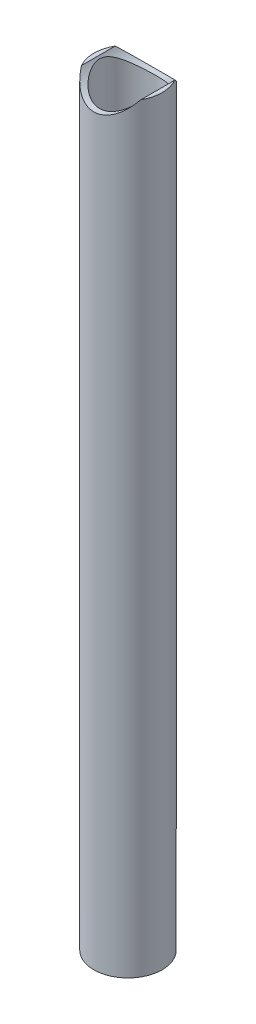
ISO-10303-21;
HEADER;
FILE_DESCRIPTION(('STEP AP214'),'2;1');
FILE_NAME('part.step','',(''),(''),'','','');
FILE_SCHEMA(('AUTOMOTIVE_DESIGN { 1 0 10303 214 1 1 1 1 }'));
ENDSEC;
DATA;
#1=APPLICATION_CONTEXT('core data for automotive mechanical design processes');
#2=APPLICATION_PROTOCOL_DEFINITION('international standard','automotive_design',2000,#1);
#3=PRODUCT_CONTEXT('',#1,'mechanical');
#4=PRODUCT('Part','Part','',(#3));
#5=PRODUCT_RELATED_PRODUCT_CATEGORY('part','',(#4));
#6=PRODUCT_DEFINITION_FORMATION('','',#4);
#7=PRODUCT_DEFINITION_CONTEXT('part definition',#1,'design');
#8=PRODUCT_DEFINITION('design','',#6,#7);
#9=PRODUCT_DEFINITION_SHAPE('','',#8);
#10=(LENGTH_UNIT() NAMED_UNIT(*) SI_UNIT(.MILLI.,.METRE.));
#11=(NAMED_UNIT(*) PLANE_ANGLE_UNIT() SI_UNIT($,.RADIAN.));
#12=(NAMED_UNIT(*) SI_UNIT($,.STERADIAN.) SOLID_ANGLE_UNIT());
#13=UNCERTAINTY_MEASURE_WITH_UNIT(LENGTH_MEASURE(1.E-05),#10,'distance_accuracy_value','');
#14=(GEOMETRIC_REPRESENTATION_CONTEXT(3) GLOBAL_UNCERTAINTY_ASSIGNED_CONTEXT((#13)) GLOBAL_UNIT_ASSIGNED_CONTEXT((#10,
#11,#12)) REPRESENTATION_CONTEXT('',''));
#15=CARTESIAN_POINT('',(0.,0.,0.));
#16=DIRECTION('',(0.,0.,1.));
#17=DIRECTION('',(1.,0.,0.));
#18=AXIS2_PLACEMENT_3D('',#15,#16,#17);
#19=CARTESIAN_POINT('',(0.,0.,0.));
#20=DIRECTION('',(0.,1.,0.));
#21=DIRECTION('',(0.,0.,1.));
#22=AXIS2_PLACEMENT_3D('',#19,#20,#21);
#23=CYLINDRICAL_SURFACE('',#22,17.526);
#24=CARTESIAN_POINT('',(17.5260000000057,467.884334709337,0.));
#25=CARTESIAN_POINT('',(17.5259966167378,467.88432617058,-0.319076188077624));
#26=CARTESIAN_POINT('',(17.51726257199,467.871890608762,-0.638240508763436));
#27=CARTESIAN_POINT('',(17.4825449115086,467.822784525985,-1.27387357273026));
#28=CARTESIAN_POINT('',(17.4565505154207,467.786098859123,-1.59034050610202));
#29=CARTESIAN_POINT('',(17.3878622453003,467.690215161303,-2.21880690947676));
#30=CARTESIAN_POINT('',(17.3451257780519,467.63095972172,-2.53079286403182));
#31=CARTESIAN_POINT('',(17.2438450795274,467.492571776205,-3.14774559895822));
#32=CARTESIAN_POINT('',(17.1852949843206,467.413431897585,-3.45270972991493));
#33=CARTESIAN_POINT('',(17.0290281907694,467.205942571117,-4.16540577796842));
#34=CARTESIAN_POINT('',(16.924830124194,467.070207980364,-4.56956911668166));
#35=CARTESIAN_POINT('',(16.6909426156402,466.774553737813,-5.36131842118699));
#36=CARTESIAN_POINT('',(16.5612408889475,466.614622439433,-5.7488962880344));
#37=CARTESIAN_POINT('',(16.2778377765882,466.27675589372,-6.50824927608016));
#38=CARTESIAN_POINT('',(16.1240772300419,466.098776656443,-6.8799824890451));
#39=CARTESIAN_POINT('',(15.7941184848056,465.730635525697,-7.60695943519018));
#40=CARTESIAN_POINT('',(15.6179210686258,465.540474057212,-7.96220374284949));
#41=CARTESIAN_POINT('',(15.1684387105771,465.074120916929,-8.79691850022176));
#42=CARTESIAN_POINT('',(14.8846663476882,464.794177119885,-9.26867500052876));
#43=CARTESIAN_POINT('',(14.2757977852007,464.228975234517,-10.1815187143384));
#44=CARTESIAN_POINT('',(13.9506852846529,463.943715087962,-10.6225937230168));
#45=CARTESIAN_POINT('',(13.2599882765244,463.376219321179,-11.4731513123116));
#46=CARTESIAN_POINT('',(12.8944394913868,463.093981269169,-11.8826612440536));
#47=CARTESIAN_POINT('',(12.1229083848525,462.539406738952,-12.6688154804112));
#48=CARTESIAN_POINT('',(11.7169405718745,462.267066755405,-13.0454714875213));
#49=CARTESIAN_POINT('',(10.9523102536056,461.793111751858,-13.6895404997737));
#50=CARTESIAN_POINT('',(10.6010399418016,461.588453168338,-13.9635083458199));
#51=CARTESIAN_POINT('',(9.87345155992662,461.19285074123,-14.4871138222371));
#52=CARTESIAN_POINT('',(9.49713454197172,461.001906322262,-14.7367524735));
#53=CARTESIAN_POINT('',(8.72070202883775,460.637341948865,-15.2090842162129));
#54=CARTESIAN_POINT('',(8.32061782316001,460.463699988611,-15.4318116129725));
#55=CARTESIAN_POINT('',(7.49751933777661,460.136876899184,-15.8480419800032));
#56=CARTESIAN_POINT('',(7.07450906657809,459.983692209281,-16.0415500368711));
#57=CARTESIAN_POINT('',(6.28025424486751,459.724825268381,-16.3667690599142));
#58=CARTESIAN_POINT('',(5.91221216564464,459.615484365574,-16.503401754469));
#59=CARTESIAN_POINT('',(5.16329368160522,459.415167450773,-16.7528138187347));
#60=CARTESIAN_POINT('',(4.7824196520745,459.324188061491,-16.8655975752347));
#61=CARTESIAN_POINT('',(4.00999437526974,459.162300485671,-17.0657472209478));
#62=CARTESIAN_POINT('',(3.61844688444468,459.091385335152,-17.1531219295349));
#63=CARTESIAN_POINT('',(2.82705689110886,458.971011274658,-17.3011693137797));
#64=CARTESIAN_POINT('',(2.42721429150704,458.921552615972,-17.3618416767118));
#65=CARTESIAN_POINT('',(1.62057958091167,458.845005592612,-17.4556549470083));
#66=CARTESIAN_POINT('',(1.2137664729376,458.818005078865,-17.4886877379134));
#67=CARTESIAN_POINT('',(0.397941374213328,458.787307210659,-17.5262391050122));
#68=CARTESIAN_POINT('',(-0.0110706209749511,458.783609903252,-17.530757623633));
#69=CARTESIAN_POINT('',(-0.827943717159224,458.799602549319,-17.5111994984361));
#70=CARTESIAN_POINT('',(-1.23580482424931,458.819292378721,-17.4871230063182));
#71=CARTESIAN_POINT('',(-2.04709283680859,458.881613358313,-17.4108036791932));
#72=CARTESIAN_POINT('',(-2.45051986964381,458.924243847782,-17.3585616553922));
#73=CARTESIAN_POINT('',(-3.22539887652972,459.028218129667,-17.2308479950609));
#74=CARTESIAN_POINT('',(-3.59729605361219,459.088256092851,-17.1569948006647));
#75=CARTESIAN_POINT('',(-4.33226890799549,459.226614528515,-16.9863018111114));
#76=CARTESIAN_POINT('',(-4.69534502405514,459.304934089606,-16.8894631618398));
#77=CARTESIAN_POINT('',(-5.41085673321429,459.478531384207,-16.6740198227789));
#78=CARTESIAN_POINT('',(-5.76329076440113,459.573811592977,-16.5554119558831));
#79=CARTESIAN_POINT('',(-6.45595687093966,459.779824257219,-16.2977871460212));
#80=CARTESIAN_POINT('',(-6.79618822322116,459.890557626474,-16.1587689961211));
#81=CARTESIAN_POINT('',(-7.49362304526296,460.136594261049,-15.8481849599276));
#82=CARTESIAN_POINT('',(-7.84955408561314,460.27321634847,-15.6748085298315));
#83=CARTESIAN_POINT('',(-8.54437048022812,460.560835019082,-15.3071530177086));
#84=CARTESIAN_POINT('',(-8.88325498620354,460.71183231655,-15.1128728969553));
#85=CARTESIAN_POINT('',(-9.54331346645607,461.026113663825,-14.7049787879664));
#86=CARTESIAN_POINT('',(-9.86448321905139,461.189400620701,-14.491360222863));
#87=CARTESIAN_POINT('',(-10.4886015638354,461.5261449485,-14.0462403039745));
#88=CARTESIAN_POINT('',(-10.7915476234653,461.699603726425,-13.8147364748272));
#89=CARTESIAN_POINT('',(-11.439848439002,462.091423252358,-13.2853358563753));
#90=CARTESIAN_POINT('',(-11.7809741839097,462.311637517782,-12.9836249082526));
#91=CARTESIAN_POINT('',(-12.4360687716025,462.760219030517,-12.3575971323187));
#92=CARTESIAN_POINT('',(-12.7500333861304,462.988587539436,-12.033276798975));
#93=CARTESIAN_POINT('',(-13.3510865510101,463.450008883021,-11.3627536857685));
#94=CARTESIAN_POINT('',(-13.6381378650007,463.683067681245,-11.0165216667337));
#95=CARTESIAN_POINT('',(-14.1847154460037,464.149482695955,-10.3032235858581));
#96=CARTESIAN_POINT('',(-14.4442441845379,464.382838883827,-9.93615939929388));
#97=CARTESIAN_POINT('',(-14.9253779852041,464.835766313745,-9.19675303324431));
#98=CARTESIAN_POINT('',(-15.1481021343213,465.055510310931,-8.82524531613509));
#99=CARTESIAN_POINT('',(-15.5673632453814,465.486269379661,-8.06270572980613));
#100=CARTESIAN_POINT('',(-15.763895326286,465.697282819178,-7.67167024009006));
#101=CARTESIAN_POINT('',(-16.1293414191598,466.104306922036,-6.87013687577863));
#102=CARTESIAN_POINT('',(-16.2982946475782,466.300338674101,-6.45966772673671));
#103=CARTESIAN_POINT('',(-16.6070872445574,466.670276739207,-5.61835143092385));
#104=CARTESIAN_POINT('',(-16.7469436463786,466.844195973576,-5.18751638865614));
#105=CARTESIAN_POINT('',(-16.9536602371012,467.108069924402,-4.45278112831981));
#106=CARTESIAN_POINT('',(-17.0293113935189,467.206686079221,-4.15445176275752));
#107=CARTESIAN_POINT('',(-17.1656161190957,467.387036358885,-3.54941976092459));
#108=CARTESIAN_POINT('',(-17.2262752409978,467.468776732321,-3.24272027165383));
#109=CARTESIAN_POINT('',(-17.3314566546328,467.612125065521,-2.62293154598005));
#110=CARTESIAN_POINT('',(-17.3760290436154,467.673795467109,-2.30986541087077));
#111=CARTESIAN_POINT('',(-17.4483464333207,467.774571318271,-1.67831422631321));
#112=CARTESIAN_POINT('',(-17.4761027039468,467.813691879544,-1.35983295349184));
#113=CARTESIAN_POINT('',(-17.5053896579413,467.855090068554,-0.867175401837867));
#114=CARTESIAN_POINT('',(-17.5131110395884,467.866037726154,-0.694043200107051));
#115=CARTESIAN_POINT('',(-17.5234176731224,467.880663137073,-0.347282765117778));
#116=CARTESIAN_POINT('',(-17.5260018413152,467.884339356482,-0.173654434935381));
#117=CARTESIAN_POINT('',(-17.5259966167301,467.884326170582,0.319076188077935));
#118=CARTESIAN_POINT('',(-17.5172625719879,467.871890608763,0.638240508763874));
#119=CARTESIAN_POINT('',(-17.4825449115106,467.822784525985,1.27387357273079));
#120=CARTESIAN_POINT('',(-17.4565505154212,467.786098859123,1.59034050610253));
#121=CARTESIAN_POINT('',(-17.3878622452997,467.690215161303,2.21880690947716));
#122=CARTESIAN_POINT('',(-17.3451257780517,467.63095972172,2.53079286403216));
#123=CARTESIAN_POINT('',(-17.2438450795275,467.492571776205,3.1477455989584));
#124=CARTESIAN_POINT('',(-17.1852949843206,467.413431897585,3.45270972991502));
#125=CARTESIAN_POINT('',(-17.0290281907693,467.205942571117,4.1654057779684));
#126=CARTESIAN_POINT('',(-16.924830124194,467.070207980364,4.56956911668161));
#127=CARTESIAN_POINT('',(-16.6909426156402,466.774553737813,5.36131842118683));
#128=CARTESIAN_POINT('',(-16.5612408889476,466.614622439433,5.74889628803413));
#129=CARTESIAN_POINT('',(-16.2778377765883,466.27675589372,6.50824927607986));
#130=CARTESIAN_POINT('',(-16.124077230042,466.098776656443,6.87998248904487));
#131=CARTESIAN_POINT('',(-15.7941184848056,465.730635525697,7.60695943519006));
#132=CARTESIAN_POINT('',(-15.6179210686258,465.540474057212,7.96220374284943));
#133=CARTESIAN_POINT('',(-15.168438710577,465.074120916929,8.79691850022182));
#134=CARTESIAN_POINT('',(-14.8846663476881,464.794177119885,9.26867500052888));
#135=CARTESIAN_POINT('',(-14.2757977852006,464.228975234517,10.1815187143386));
#136=CARTESIAN_POINT('',(-13.9506852846527,463.943715087962,10.622593723017));
#137=CARTESIAN_POINT('',(-13.2599882765243,463.376219321178,11.4731513123118));
#138=CARTESIAN_POINT('',(-12.8944394913867,463.093981269169,11.8826612440537));
#139=CARTESIAN_POINT('',(-12.1229083848524,462.539406738952,12.6688154804112));
#140=CARTESIAN_POINT('',(-11.7169405718744,462.267066755405,13.0454714875213));
#141=CARTESIAN_POINT('',(-10.9523102536056,461.793111751858,13.6895404997737));
#142=CARTESIAN_POINT('',(-10.6010399418017,461.588453168338,13.9635083458199));
#143=CARTESIAN_POINT('',(-9.87345155992667,461.19285074123,14.4871138222371));
#144=CARTESIAN_POINT('',(-9.49713454197178,461.001906322262,14.7367524735));
#145=CARTESIAN_POINT('',(-8.72070202883782,460.637341948865,15.2090842162129));
#146=CARTESIAN_POINT('',(-8.32061782316007,460.463699988611,15.4318116129724));
#147=CARTESIAN_POINT('',(-7.49751933777664,460.136876899184,15.8480419800032));
#148=CARTESIAN_POINT('',(-7.07450906657811,459.983692209281,16.0415500368711));
#149=CARTESIAN_POINT('',(-6.28025424486751,459.724825268381,16.3667690599142));
#150=CARTESIAN_POINT('',(-5.91221216564464,459.615484365574,16.503401754469));
#151=CARTESIAN_POINT('',(-5.1632936816052,459.415167450773,16.7528138187347));
#152=CARTESIAN_POINT('',(-4.78241965207447,459.324188061491,16.8655975752347));
#153=CARTESIAN_POINT('',(-4.00999437526971,459.162300485671,17.0657472209478));
#154=CARTESIAN_POINT('',(-3.61844688444465,459.091385335152,17.153121929535));
#155=CARTESIAN_POINT('',(-2.82705689110885,458.971011274658,17.3011693137798));
#156=CARTESIAN_POINT('',(-2.42721429150704,458.921552615972,17.3618416767118));
#157=CARTESIAN_POINT('',(-1.62057958091167,458.845005592612,17.4556549470083));
#158=CARTESIAN_POINT('',(-1.2137664729376,458.818005078865,17.4886877379134));
#159=CARTESIAN_POINT('',(-0.397941374213323,458.787307210659,17.5262391050122));
#160=CARTESIAN_POINT('',(0.0110706209749554,458.783609903252,17.530757623633));
#161=CARTESIAN_POINT('',(0.827943717159227,458.799602549319,17.5111994984361));
#162=CARTESIAN_POINT('',(1.23580482424931,458.819292378721,17.4871230063182));
#163=CARTESIAN_POINT('',(2.0470928368086,458.881613358313,17.4108036791932));
#164=CARTESIAN_POINT('',(2.45051986964381,458.924243847782,17.3585616553922));
#165=CARTESIAN_POINT('',(3.22539887652971,459.028218129667,17.2308479950609));
#166=CARTESIAN_POINT('',(3.59729605361216,459.088256092851,17.1569948006648));
#167=CARTESIAN_POINT('',(4.33226890799546,459.226614528515,16.9863018111114));
#168=CARTESIAN_POINT('',(4.69534502405511,459.304934089606,16.8894631618398));
#169=CARTESIAN_POINT('',(5.41085673321427,459.478531384207,16.6740198227789));
#170=CARTESIAN_POINT('',(5.76329076440111,459.573811592977,16.5554119558831));
#171=CARTESIAN_POINT('',(6.45595687093965,459.779824257219,16.2977871460212));
#172=CARTESIAN_POINT('',(6.79618822322116,459.890557626474,16.1587689961211));
#173=CARTESIAN_POINT('',(7.49362304526297,460.136594261049,15.8481849599276));
#174=CARTESIAN_POINT('',(7.84955408561315,460.27321634847,15.6748085298315));
#175=CARTESIAN_POINT('',(8.54437048022813,460.560835019082,15.3071530177086));
#176=CARTESIAN_POINT('',(8.88325498620355,460.71183231655,15.1128728969553));
#177=CARTESIAN_POINT('',(9.54331346645609,461.026113663825,14.7049787879664));
#178=CARTESIAN_POINT('',(9.86448321905142,461.189400620701,14.491360222863));
#179=CARTESIAN_POINT('',(10.4886015638354,461.526144948501,14.0462403039745));
#180=CARTESIAN_POINT('',(10.7915476234653,461.699603726425,13.8147364748272));
#181=CARTESIAN_POINT('',(11.4398484390019,462.091423252358,13.2853358563754));
#182=CARTESIAN_POINT('',(11.7809741839097,462.311637517782,12.9836249082527));
#183=CARTESIAN_POINT('',(12.4360687716024,462.760219030517,12.3575971323188));
#184=CARTESIAN_POINT('',(12.7500333861304,462.988587539436,12.0332767989751));
#185=CARTESIAN_POINT('',(13.3510865510101,463.450008883021,11.3627536857686));
#186=CARTESIAN_POINT('',(13.6381378650006,463.683067681245,11.0165216667338));
#187=CARTESIAN_POINT('',(14.1847154460037,464.149482695955,10.3032235858581));
#188=CARTESIAN_POINT('',(14.4442441845379,464.382838883827,9.93615939929389));
#189=CARTESIAN_POINT('',(14.9253779852041,464.835766313745,9.19675303324428));
#190=CARTESIAN_POINT('',(15.1481021343214,465.055510310931,8.82524531613502));
#191=CARTESIAN_POINT('',(15.5673632453815,465.486269379661,8.06270572980595));
#192=CARTESIAN_POINT('',(15.7638953262862,465.697282819178,7.67167024008982));
#193=CARTESIAN_POINT('',(16.1293414191599,466.104306922036,6.87013687577837));
#194=CARTESIAN_POINT('',(16.2982946475783,466.300338674101,6.45966772673649));
#195=CARTESIAN_POINT('',(16.6070872445575,466.670276739207,5.61835143092374));
#196=CARTESIAN_POINT('',(16.7469436463786,466.844195973576,5.18751638865608));
#197=CARTESIAN_POINT('',(16.9536602371012,467.108069924402,4.45278112831985));
#198=CARTESIAN_POINT('',(17.0293113935189,467.206686079221,4.15445176275761));
#199=CARTESIAN_POINT('',(17.1656161190957,467.387036358884,3.54941976092476));
#200=CARTESIAN_POINT('',(17.2262752409979,467.468776732321,3.24272027165403));
#201=CARTESIAN_POINT('',(17.3314566546327,467.61212506552,2.62293154598024));
#202=CARTESIAN_POINT('',(17.3760290436152,467.673795467109,2.30986541087091));
#203=CARTESIAN_POINT('',(17.4483464333209,467.774571318271,1.67831422631326));
#204=CARTESIAN_POINT('',(17.4761027039476,467.813691879544,1.35983295349187));
#205=CARTESIAN_POINT('',(17.5053896579408,467.855090068554,0.867175401837875));
#206=CARTESIAN_POINT('',(17.5131110395871,467.866037726155,0.694043200107066));
#207=CARTESIAN_POINT('',(17.5234176731237,467.880663137073,0.347282765117854));
#208=CARTESIAN_POINT('',(17.5260018413198,467.884339356481,0.173654434935511));
#209=CARTESIAN_POINT('',(17.5260000000057,467.884334709337,0.));
#210=B_SPLINE_CURVE_WITH_KNOTS('',3,(#24,#25,#26,#27,#28,#29,#30,#31,#32,#33,#34,#35,#36,#37,
#38,#39,#40,#41,#42,#43,#44,#45,#46,#47,#48,#49,#50,#51,#52,#53,#54,#55,#56,#57,#58,#59,#60,#61,
#62,#63,#64,#65,#66,#67,#68,#69,#70,#71,#72,#73,#74,#75,#76,#77,#78,#79,#80,#81,#82,#83,#84,#85,
#86,#87,#88,#89,#90,#91,#92,#93,#94,#95,#96,#97,#98,#99,#100,#101,#102,#103,#104,#105,#106,#107,
#108,#109,#110,#111,#112,#113,#114,#115,#116,#117,#118,#119,#120,#121,#122,#123,#124,#125,#126,
#127,#128,#129,#130,#131,#132,#133,#134,#135,#136,#137,#138,#139,#140,#141,#142,#143,#144,#145,
#146,#147,#148,#149,#150,#151,#152,#153,#154,#155,#156,#157,#158,#159,#160,#161,#162,#163,#164,
#165,#166,#167,#168,#169,#170,#171,#172,#173,#174,#175,#176,#177,#178,#179,#180,#181,#182,#183,
#184,#185,#186,#187,#188,#189,#190,#191,#192,#193,#194,#195,#196,#197,#198,#199,#200,#201,#202,
#203,#204,#205,#206,#207,#208,#209),.UNSPECIFIED.,.T.,.F.,(4,2,2,2,2,2,2,2,2,2,2,2,2,2,2,2,2,2,
2,2,2,2,2,2,2,2,2,2,2,2,2,2,2,2,2,2,2,2,2,2,2,2,2,2,2,2,2,2,2,2,2,2,2,2,2,2,2,2,2,2,2,2,2,2,2,2,
2,2,2,2,2,2,2,2,2,2,2,2,2,2,2,2,2,2,2,2,2,2,2,2,2,2,4),(0.,0.957028803679463,1.9146559049294,
2.87473527777311,3.83517115241394,5.14973807242214,6.46493975677991,7.78342788903949,
9.10187005018092,10.9523123288732,12.8034865367084,14.6530382372429,16.5019284180806,
17.9713466941596,19.4407032845167,20.9081665857837,22.3753741310654,23.5967404641885,
24.8178819425912,26.0385990606161,27.2593304747379,28.4848149366935,29.710301873008,
30.9357823079984,32.1612274493443,33.311629001132,34.4619732144101,35.6124854482696,
36.7630657435203,38.0183344145918,39.2736654901255,40.5292944479692,41.7850975001873,
43.3012548619961,44.8176478255635,46.3361087816726,47.8544332646222,49.3104622613961,
50.7667622190167,52.2209729662504,53.6743300092622,54.6431268243694,55.6115642773947,
56.576959258516,57.5417065290147,58.0624512765263,58.5833058633924,59.5403346670722,
60.497961768322,61.4580411411656,62.4184770158061,63.7330439358142,65.0482456201717,
66.3667337524314,67.6851759135731,69.5356181922656,71.386792400101,73.2363441006352,
75.0852342814728,76.5546525575518,78.0240091479088,79.4914724491758,80.9586799944576,
82.1800463275807,83.4011878059835,84.6219049240083,85.8426363381301,87.0681208000857,
88.2936077364002,89.5190881713906,90.7445333127364,91.8949348645241,93.0452790778023,
94.1957913116618,95.3463716069124,96.601640277984,97.8569713535177,99.1126003113614,
100.368403363579,101.884560725388,103.400953688955,104.919414645065,106.437739128014,
107.893768124788,109.350068082409,110.804278829643,112.257635872654,113.226432687761,
114.194870140787,115.160265121908,116.125012392407,116.645757139918,117.166611726784),.UNSPECIFIED.);
#211=CARTESIAN_POINT('',(17.5260000000057,467.884334709337,0.));
#212=VERTEX_POINT('',#211);
#213=EDGE_CURVE('E20',#212,#212,#210,.T.);
#214=ORIENTED_EDGE('',*,*,#213,.T.);
#215=EDGE_LOOP('',(#214));
#216=FACE_BOUND('',#215,.T.);
#217=CARTESIAN_POINT('',(-14.7320000000002,0.,-9.49362164824335));
#218=CARTESIAN_POINT('',(-14.8512768378807,1.18567366094348E-05,-9.30853858785234));
#219=CARTESIAN_POINT('',(-14.9670401513545,0.00336025535581087,-9.12123138228475));
#220=CARTESIAN_POINT('',(-15.1913280769663,0.0156361272029989,-8.74257363879652));
#221=CARTESIAN_POINT('',(-15.2998546298961,0.0245620978949944,-8.55122420321666));
#222=CARTESIAN_POINT('',(-15.5094219734196,0.0468896508454727,-8.16497091437258));
#223=CARTESIAN_POINT('',(-15.6104697947254,0.0602869626121937,-7.97007061974777));
#224=CARTESIAN_POINT('',(-15.8050766923314,0.0905510610284354,-7.57683077316113));
#225=CARTESIAN_POINT('',(-15.8986352341418,0.107418094996536,-7.37849097695814));
#226=CARTESIAN_POINT('',(-16.1683109406556,0.161847115220246,-6.77785226085186));
#227=CARTESIAN_POINT('',(-16.3330093959,0.203184711084875,-6.37070633388372));
#228=CARTESIAN_POINT('',(-16.6313329505743,0.288719471062349,-5.54545234654736));
#229=CARTESIAN_POINT('',(-16.7649519139684,0.33291719765398,-5.1273421395977));
#230=CARTESIAN_POINT('',(-16.989149442954,0.413623974218271,-4.32279802081029));
#231=CARTESIAN_POINT('',(-17.0826397029462,0.450463273768551,-3.93720826814375));
#232=CARTESIAN_POINT('',(-17.2433279085767,0.517048885333327,-3.16002017297867));
#233=CARTESIAN_POINT('',(-17.3105301942946,0.546796367872237,-2.76842283342149));
#234=CARTESIAN_POINT('',(-17.4181006554558,0.595796397634473,-1.98183023019654));
#235=CARTESIAN_POINT('',(-17.4585311972106,0.615073317654542,-1.58684505055578));
#236=CARTESIAN_POINT('',(-17.5124805157628,0.641027782057902,-0.794550289194888));
#237=CARTESIAN_POINT('',(-17.5259976422763,0.647704553820625,-0.39724056643585));
#238=CARTESIAN_POINT('',(-17.5260013446963,0.647719611364174,0.226560860476848));
#239=CARTESIAN_POINT('',(-17.5216065525146,0.64555635278682,0.453099225514268));
#240=CARTESIAN_POINT('',(-17.5040436962304,0.636998814319318,0.905771133232719));
#241=CARTESIAN_POINT('',(-17.4908754188329,0.630604431564945,1.13190466593772));
#242=CARTESIAN_POINT('',(-17.4557990255929,0.613816973869189,1.58335761895379));
#243=CARTESIAN_POINT('',(-17.4338903157912,0.603423627178539,1.80867698288753));
#244=CARTESIAN_POINT('',(-17.3813925618602,0.579034466592906,2.25811317057391));
#245=CARTESIAN_POINT('',(-17.3508027010911,0.565038313791909,2.48222987917032));
#246=CARTESIAN_POINT('',(-17.2459295569409,0.518308316325325,3.15340303711726));
#247=CARTESIAN_POINT('',(-17.1586295918297,0.480878860619408,3.59816727949413));
#248=CARTESIAN_POINT('',(-16.9500707191891,0.398936749124965,4.47891555375538));
#249=CARTESIAN_POINT('',(-16.8288114805177,0.354424024268253,4.91489949997736));
#250=CARTESIAN_POINT('',(-16.5740184826926,0.271797924889355,5.71046688209059));
#251=CARTESIAN_POINT('',(-16.4451743864335,0.233743522671846,6.07156461238672));
#252=CARTESIAN_POINT('',(-16.1639804343157,0.161866969447925,6.78478502075457));
#253=CARTESIAN_POINT('',(-16.0116391141145,0.128043289627202,7.1369109040527));
#254=CARTESIAN_POINT('',(-15.6843812976354,0.0696335181760638,7.82988555736756));
#255=CARTESIAN_POINT('',(-15.5095453317572,0.0450156421794435,8.17076935360042));
#256=CARTESIAN_POINT('',(-15.2304938677732,0.0189072501565633,8.67349628714565));
#257=CARTESIAN_POINT('',(-15.1346193031661,0.0120067029515504,8.83972858230823));
#258=CARTESIAN_POINT('',(-14.9373887586073,0.00255573299417623,9.16907579603087));
#259=CARTESIAN_POINT('',(-14.8360317138495,6.15843913342474E-06,9.3321901006296));
#260=CARTESIAN_POINT('',(-14.7320000000002,0.,9.49362164824335));
#261=B_SPLINE_CURVE_WITH_KNOTS('',3,(#217,#218,#219,#220,#221,#222,#223,#224,#225,#226,#227,
#228,#229,#230,#231,#232,#233,#234,#235,#236,#237,#238,#239,#240,#241,#242,#243,#244,#245,#246,
#247,#248,#249,#250,#251,#252,#253,#254,#255,#256,#257,#258,#259,#260),.UNSPECIFIED.,.F.,.F.,(4,
2,2,2,2,2,2,2,2,2,2,2,2,2,2,2,2,2,2,2,2,4),(0.,0.660450268660075,1.32072269600756,
1.9803663059287,2.6400569509366,3.9620711134059,5.28434606050904,6.47882279439166,
7.67310223981106,8.86458966228416,10.0561501424516,10.7357407746952,11.4153479292929,
12.0950012746982,12.7747185765936,14.1375014803103,15.5002976731889,16.6553293330489,
17.8099423972659,18.9605313569332,19.5364648376884,20.1125105805729),.UNSPECIFIED.);
#262=CARTESIAN_POINT('',(-14.7320000000001,0.,-9.49362164824348));
#263=VERTEX_POINT('',#262);
#264=CARTESIAN_POINT('',(-14.7320000000001,0.,9.49362164824348));
#265=VERTEX_POINT('',#264);
#266=EDGE_CURVE('E111',#263,#265,#261,.T.);
#267=ORIENTED_EDGE('',*,*,#266,.F.);
#268=CARTESIAN_POINT('',(0.,0.,0.));
#269=DIRECTION('',(0.,1.,0.));
#270=DIRECTION('',(0.,0.,1.));
#271=AXIS2_PLACEMENT_3D('',#268,#269,#270);
#272=CIRCLE('',#271,17.526);
#273=EDGE_CURVE('E82',#263,#265,#272,.F.);
#274=ORIENTED_EDGE('',*,*,#273,.T.);
#275=EDGE_LOOP('',(#267,#274));
#276=FACE_BOUND('',#275,.T.);
#277=ADVANCED_FACE('F16',(#216,#276),#23,.F.);
#278=CARTESIAN_POINT('',(0.,469.10625,0.));
#279=DIRECTION('',(0.,1.,0.));
#280=DIRECTION('',(0.,0.,1.));
#281=AXIS2_PLACEMENT_3D('',#278,#279,#280);
#282=PLANE('',#281);
#283=CARTESIAN_POINT('',(0.,469.10625,0.));
#284=DIRECTION('',(0.,1.,0.));
#285=DIRECTION('',(0.,0.,1.));
#286=AXIS2_PLACEMENT_3D('',#283,#284,#285);
#287=CIRCLE('',#286,21.082);
#288=CARTESIAN_POINT('',(-18.3251417542268,469.10625,10.4230467564668));
#289=VERTEX_POINT('',#288);
#290=CARTESIAN_POINT('',(-18.3251417542266,469.10625,-10.4230467564672));
#291=VERTEX_POINT('',#290);
#292=EDGE_CURVE('E59',#289,#291,#287,.F.);
#293=ORIENTED_EDGE('',*,*,#292,.F.);
#294=DIRECTION('',(0.,0.,1.));
#295=VECTOR('',#294,1.);
#296=CARTESIAN_POINT('',(-18.325141754227,469.106250000001,-59.1058));
#297=LINE('',#296,#295);
#298=EDGE_CURVE('E81',#289,#291,#297,.F.);
#299=ORIENTED_EDGE('',*,*,#298,.T.);
#300=EDGE_LOOP('',(#293,#299));
#301=FACE_BOUND('',#300,.T.);
#302=ADVANCED_FACE('F141',(#301),#282,.T.);
#303=CARTESIAN_POINT('',(0.,480.21875,-59.1058));
#304=DIRECTION('',(0.,0.,1.));
#305=DIRECTION('',(1.,0.,0.));
#306=AXIS2_PLACEMENT_3D('',#303,#304,#305);
#307=CYLINDRICAL_SURFACE('',#306,21.43125);
#308=ORIENTED_EDGE('',*,*,#213,.F.);
#309=EDGE_LOOP('',(#308));
#310=FACE_BOUND('',#309,.T.);
#311=DIRECTION('',(0.,0.,1.));
#312=VECTOR('',#311,1.);
#313=CARTESIAN_POINT('',(18.3251417542254,469.10625,0.));
#314=LINE('',#313,#312);
#315=CARTESIAN_POINT('',(18.325141754226,469.10625,-10.4230467564682));
#316=VERTEX_POINT('',#315);
#317=CARTESIAN_POINT('',(18.3251417542258,469.10625,10.4230467564686));
#318=VERTEX_POINT('',#317);
#319=EDGE_CURVE('E76',#316,#318,#314,.T.);
#320=ORIENTED_EDGE('',*,*,#319,.F.);
#321=CARTESIAN_POINT('',(-18.3251417542262,469.106249999999,-10.4230467564679));
#322=CARTESIAN_POINT('',(-18.1546669610887,468.825127971071,-10.7227290527011));
#323=CARTESIAN_POINT('',(-17.9762521103228,468.545502562748,-11.0193331862278));
#324=CARTESIAN_POINT('',(-17.603174683745,467.990150326794,-11.6060349899294));
#325=CARTESIAN_POINT('',(-17.4085087028067,467.714424330437,-11.8961312802681));
#326=CARTESIAN_POINT('',(-17.0019836765292,467.167021169007,-12.4702576819994));
#327=CARTESIAN_POINT('',(-16.7900716325992,466.895359774209,-12.7542654238679));
#328=CARTESIAN_POINT('',(-16.3492935730373,466.358020228613,-13.3145928128943));
#329=CARTESIAN_POINT('',(-16.1204285684027,466.092341722253,-13.5909129171583));
#330=CARTESIAN_POINT('',(-15.4019360975931,465.299230269302,-14.4140977013324));
#331=CARTESIAN_POINT('',(-14.8853547110108,464.782459591846,-14.9481374038877));
#332=CARTESIAN_POINT('',(-13.7792427951948,463.787584313184,-15.9734367489108));
#333=CARTESIAN_POINT('',(-13.189821109303,463.309423744234,-16.4647583961952));
#334=CARTESIAN_POINT('',(-12.1914293172031,462.587014082934,-17.2056406985864));
#335=CARTESIAN_POINT('',(-11.8065697558803,462.326726905096,-17.4722548638437));
#336=CARTESIAN_POINT('',(-11.0105895807883,461.826187579026,-17.984481249431));
#337=CARTESIAN_POINT('',(-10.5994692284442,461.585935231403,-18.2300936787757));
#338=CARTESIAN_POINT('',(-9.75332190905766,461.129451847357,-18.6964116129859));
#339=CARTESIAN_POINT('',(-9.31840297433261,460.91312386012,-18.9172177051281));
#340=CARTESIAN_POINT('',(-8.42422790375238,460.506521818928,-19.3319907253941));
#341=CARTESIAN_POINT('',(-7.9649754708652,460.316243816501,-19.5259617210382));
#342=CARTESIAN_POINT('',(-7.09342871479429,459.990920590372,-19.8574465979527));
#343=CARTESIAN_POINT('',(-6.68419026822036,459.851868174079,-19.9990679012435));
#344=CARTESIAN_POINT('',(-5.8511268704562,459.597100131136,-20.2584620806643));
#345=CARTESIAN_POINT('',(-5.42730320377621,459.481382455538,-20.3762370506676));
#346=CARTESIAN_POINT('',(-4.56718208473583,459.275136629058,-20.586101259301));
#347=CARTESIAN_POINT('',(-4.13088142691732,459.184615016574,-20.6781838307488));
#348=CARTESIAN_POINT('',(-3.24868439523585,459.030427516734,-20.8350056910957));
#349=CARTESIAN_POINT('',(-2.8027879510906,458.96676182615,-20.8997447796517));
#350=CARTESIAN_POINT('',(-1.90287739277508,458.867327242993,-21.0008472531159));
#351=CARTESIAN_POINT('',(-1.44883815025849,458.831669663795,-21.0370974140346));
#352=CARTESIAN_POINT('',(-0.538006059784569,458.789404091888,-21.0800647183436));
#353=CARTESIAN_POINT('',(-0.081213206735805,458.782796152909,-21.0867818071104));
#354=CARTESIAN_POINT('',(0.831309948877434,458.798767722317,-21.070545561698));
#355=CARTESIAN_POINT('',(1.28704029102061,458.821346125526,-21.0475933509843));
#356=CARTESIAN_POINT('',(2.19371817036819,458.895219582443,-20.9724877595272));
#357=CARTESIAN_POINT('',(2.64466584274158,458.946513822362,-20.9203352063041));
#358=CARTESIAN_POINT('',(3.50770609591001,459.072320812162,-20.7923986040815));
#359=CARTESIAN_POINT('',(3.92034567137933,459.145004231551,-20.7184761705479));
#360=CARTESIAN_POINT('',(4.73598238868334,459.313192644567,-20.5473799397617));
#361=CARTESIAN_POINT('',(5.13898027223503,459.408695876458,-20.4502079374216));
#362=CARTESIAN_POINT('',(5.93310060888487,459.621039980175,-20.2340878173185));
#363=CARTESIAN_POINT('',(6.32422847038821,459.737870958774,-20.1151497960193));
#364=CARTESIAN_POINT('',(7.09319682724352,459.991317793235,-19.8570354633955));
#365=CARTESIAN_POINT('',(7.47103470832531,460.127937514986,-19.7178551975656));
#366=CARTESIAN_POINT('',(8.340921313972,460.469946081268,-19.369279852933));
#367=CARTESIAN_POINT('',(8.82704161820418,460.682736203744,-19.152290298958));
#368=CARTESIAN_POINT('',(9.77073130008474,461.137193328205,-18.6885043360116));
#369=CARTESIAN_POINT('',(10.2282920791791,461.378868963661,-18.4416990152905));
#370=CARTESIAN_POINT('',(11.1158361575877,461.888453446346,-17.9207966626516));
#371=CARTESIAN_POINT('',(11.5456750314956,462.156483773913,-17.6465731401195));
#372=CARTESIAN_POINT('',(12.3748903198028,462.714171278575,-17.075314038865));
#373=CARTESIAN_POINT('',(12.7742679744506,463.003827574204,-16.7782793899018));
#374=CARTESIAN_POINT('',(13.7124897818912,463.733645797195,-16.028758966349));
#375=CARTESIAN_POINT('',(14.2350475461894,464.18378895832,-15.5655468252942));
#376=CARTESIAN_POINT('',(15.2190283134204,465.114486226377,-14.6049737541161));
#377=CARTESIAN_POINT('',(15.6803907163066,465.595069792127,-14.1075797035255));
#378=CARTESIAN_POINT('',(16.324811803929,466.329787776438,-13.343920259532));
#379=CARTESIAN_POINT('',(16.5304862544951,466.575347818195,-13.0881707638872));
#380=CARTESIAN_POINT('',(16.92761092984,467.071302268908,-12.5703293638291));
#381=CARTESIAN_POINT('',(17.1190605520851,467.32169688208,-12.3082371913762));
#382=CARTESIAN_POINT('',(17.487555959223,467.825963253307,-11.7787923049527));
#383=CARTESIAN_POINT('',(17.6646331720468,468.079825924068,-11.5114527485789));
#384=CARTESIAN_POINT('',(18.0050885953852,468.590788388003,-10.9712927485365));
#385=CARTESIAN_POINT('',(18.1684689248275,468.847887673364,-10.6984731607618));
#386=CARTESIAN_POINT('',(18.3251417542261,469.106249999999,-10.423046756468));
#387=B_SPLINE_CURVE_WITH_KNOTS('',3,(#321,#322,#323,#324,#325,#326,#327,#328,#329,#330,#331,
#332,#333,#334,#335,#336,#337,#338,#339,#340,#341,#342,#343,#344,#345,#346,#347,#348,#349,#350,
#351,#352,#353,#354,#355,#356,#357,#358,#359,#360,#361,#362,#363,#364,#365,#366,#367,#368,#369,
#370,#371,#372,#373,#374,#375,#376,#377,#378,#379,#380,#381,#382,#383,#384,#385,#386),
.UNSPECIFIED.,.F.,.F.,(4,2,2,2,2,2,2,2,2,2,2,2,2,2,2,2,2,2,2,2,2,2,2,2,2,2,2,2,2,2,2,2,4),(0.,
1.33452893394796,2.66933819920094,4.00841669165642,5.34741539176811,8.05809253862444,
10.7647670882868,12.3705739735535,13.9763648755617,15.5753896052759,17.1741716972087,
18.5373035315692,19.9003156215439,21.2636810851514,22.6270565378386,23.9958234528493,
25.3645928994931,26.7333105174726,28.1019893487803,29.3769961752555,30.6519046004351,
31.9262231341472,33.2007909527299,34.9181886395385,36.6361009219446,38.3623403383522,
40.0885094322291,42.576889506624,45.0677156439948,46.2971212647798,47.5265789309453,
48.7532713604119,49.9797736672352),.UNSPECIFIED.);
#388=EDGE_CURVE('E73',#291,#316,#387,.T.);
#389=ORIENTED_EDGE('',*,*,#388,.F.);
#390=ORIENTED_EDGE('',*,*,#298,.F.);
#391=CARTESIAN_POINT('',(18.3251417542262,469.106249999999,10.4230467564679));
#392=CARTESIAN_POINT('',(18.1546669610887,468.825127971071,10.7227290527011));
#393=CARTESIAN_POINT('',(17.9762521103228,468.545502562748,11.0193331862278));
#394=CARTESIAN_POINT('',(17.603174683745,467.990150326794,11.6060349899294));
#395=CARTESIAN_POINT('',(17.4085087028067,467.714424330437,11.8961312802681));
#396=CARTESIAN_POINT('',(17.0019836765292,467.167021169007,12.4702576819994));
#397=CARTESIAN_POINT('',(16.7900716325992,466.895359774209,12.7542654238679));
#398=CARTESIAN_POINT('',(16.3492935730373,466.358020228613,13.3145928128943));
#399=CARTESIAN_POINT('',(16.1204285684027,466.092341722253,13.5909129171583));
#400=CARTESIAN_POINT('',(15.4019360975931,465.299230269302,14.4140977013324));
#401=CARTESIAN_POINT('',(14.8853547110108,464.782459591846,14.9481374038877));
#402=CARTESIAN_POINT('',(13.7792427951948,463.787584313184,15.9734367489108));
#403=CARTESIAN_POINT('',(13.189821109303,463.309423744234,16.4647583961952));
#404=CARTESIAN_POINT('',(12.1914293172031,462.587014082934,17.2056406985864));
#405=CARTESIAN_POINT('',(11.8065697558803,462.326726905096,17.4722548638437));
#406=CARTESIAN_POINT('',(11.0105895807883,461.826187579026,17.984481249431));
#407=CARTESIAN_POINT('',(10.5994692284442,461.585935231403,18.2300936787757));
#408=CARTESIAN_POINT('',(9.75332190905766,461.129451847357,18.6964116129859));
#409=CARTESIAN_POINT('',(9.3184029743326,460.91312386012,18.9172177051281));
#410=CARTESIAN_POINT('',(8.42422790375238,460.506521818928,19.3319907253941));
#411=CARTESIAN_POINT('',(7.9649754708652,460.316243816501,19.5259617210382));
#412=CARTESIAN_POINT('',(7.09342871479429,459.990920590372,19.8574465979527));
#413=CARTESIAN_POINT('',(6.68419026822036,459.851868174079,19.9990679012435));
#414=CARTESIAN_POINT('',(5.8511268704562,459.597100131136,20.2584620806643));
#415=CARTESIAN_POINT('',(5.42730320377621,459.481382455538,20.3762370506676));
#416=CARTESIAN_POINT('',(4.56718208473583,459.275136629058,20.586101259301));
#417=CARTESIAN_POINT('',(4.13088142691732,459.184615016574,20.6781838307488));
#418=CARTESIAN_POINT('',(3.24868439523585,459.030427516734,20.8350056910957));
#419=CARTESIAN_POINT('',(2.8027879510906,458.96676182615,20.8997447796517));
#420=CARTESIAN_POINT('',(1.90287739277508,458.867327242993,21.0008472531159));
#421=CARTESIAN_POINT('',(1.44883815025849,458.831669663795,21.0370974140346));
#422=CARTESIAN_POINT('',(0.538006059784568,458.789404091888,21.0800647183436));
#423=CARTESIAN_POINT('',(0.0812132067358033,458.782796152909,21.0867818071104));
#424=CARTESIAN_POINT('',(-0.831309948877435,458.798767722317,21.070545561698));
#425=CARTESIAN_POINT('',(-1.28704029102061,458.821346125526,21.0475933509843));
#426=CARTESIAN_POINT('',(-2.19371817036819,458.895219582443,20.9724877595272));
#427=CARTESIAN_POINT('',(-2.64466584274158,458.946513822362,20.9203352063041));
#428=CARTESIAN_POINT('',(-3.50770609591002,459.072320812162,20.7923986040815));
#429=CARTESIAN_POINT('',(-3.92034567137934,459.145004231551,20.7184761705479));
#430=CARTESIAN_POINT('',(-4.73598238868335,459.313192644567,20.5473799397617));
#431=CARTESIAN_POINT('',(-5.13898027223504,459.408695876458,20.4502079374216));
#432=CARTESIAN_POINT('',(-5.93310060888487,459.621039980175,20.2340878173185));
#433=CARTESIAN_POINT('',(-6.32422847038821,459.737870958774,20.1151497960193));
#434=CARTESIAN_POINT('',(-7.09319682724352,459.991317793235,19.8570354633955));
#435=CARTESIAN_POINT('',(-7.47103470832531,460.127937514986,19.7178551975656));
#436=CARTESIAN_POINT('',(-8.340921313972,460.469946081268,19.369279852933));
#437=CARTESIAN_POINT('',(-8.82704161820416,460.682736203744,19.152290298958));
#438=CARTESIAN_POINT('',(-9.77073130008473,461.137193328205,18.6885043360116));
#439=CARTESIAN_POINT('',(-10.228292079179,461.378868963661,18.4416990152905));
#440=CARTESIAN_POINT('',(-11.1158361575877,461.888453446346,17.9207966626516));
#441=CARTESIAN_POINT('',(-11.5456750314956,462.156483773913,17.6465731401195));
#442=CARTESIAN_POINT('',(-12.3748903198028,462.714171278575,17.075314038865));
#443=CARTESIAN_POINT('',(-12.7742679744506,463.003827574204,16.7782793899018));
#444=CARTESIAN_POINT('',(-13.7124897818912,463.733645797195,16.0287589663489));
#445=CARTESIAN_POINT('',(-14.2350475461895,464.18378895832,15.5655468252941));
#446=CARTESIAN_POINT('',(-15.2190283134206,465.114486226378,14.6049737541159));
#447=CARTESIAN_POINT('',(-15.6803907163068,465.595069792127,14.1075797035253));
#448=CARTESIAN_POINT('',(-16.3248118039293,466.329787776439,13.3439202595317));
#449=CARTESIAN_POINT('',(-16.5304862544954,466.575347818196,13.0881707638868));
#450=CARTESIAN_POINT('',(-16.9276109298404,467.071302268908,12.5703293638287));
#451=CARTESIAN_POINT('',(-17.1190605520855,467.321696882081,12.3082371913757));
#452=CARTESIAN_POINT('',(-17.4875559592233,467.825963253307,11.7787923049522));
#453=CARTESIAN_POINT('',(-17.6646331720472,468.079825924069,11.5114527485783));
#454=CARTESIAN_POINT('',(-18.0050885953855,468.590788388004,10.9712927485359));
#455=CARTESIAN_POINT('',(-18.1684689248279,468.847887673364,10.6984731607611));
#456=CARTESIAN_POINT('',(-18.3251417542265,469.10625,10.4230467564673));
#457=B_SPLINE_CURVE_WITH_KNOTS('',3,(#391,#392,#393,#394,#395,#396,#397,#398,#399,#400,#401,
#402,#403,#404,#405,#406,#407,#408,#409,#410,#411,#412,#413,#414,#415,#416,#417,#418,#419,#420,
#421,#422,#423,#424,#425,#426,#427,#428,#429,#430,#431,#432,#433,#434,#435,#436,#437,#438,#439,
#440,#441,#442,#443,#444,#445,#446,#447,#448,#449,#450,#451,#452,#453,#454,#455,#456),
.UNSPECIFIED.,.F.,.F.,(4,2,2,2,2,2,2,2,2,2,2,2,2,2,2,2,2,2,2,2,2,2,2,2,2,2,2,2,2,2,2,2,4),(0.,
1.33452893394795,2.66933819920093,4.00841669165642,5.34741539176811,8.05809253862444,
10.7647670882868,12.3705739735535,13.9763648755617,15.5753896052759,17.1741716972087,
18.5373035315692,19.9003156215439,21.2636810851514,22.6270565378386,23.9958234528493,
25.3645928994931,26.7333105174726,28.1019893487803,29.3769961752555,30.6519046004351,
31.9262231341472,33.2007909527299,34.9181886395385,36.6361009219446,38.3623403383522,
40.0885094322291,42.5768895066242,45.0677156439953,46.2971212647805,47.5265789309461,
48.7532713604128,49.9797736672361),.UNSPECIFIED.);
#458=EDGE_CURVE('E71',#318,#289,#457,.T.);
#459=ORIENTED_EDGE('',*,*,#458,.F.);
#460=EDGE_LOOP('',(#320,#389,#390,#459));
#461=FACE_BOUND('',#460,.T.);
#462=ADVANCED_FACE('F80',(#310,#461),#307,.F.);
#463=CARTESIAN_POINT('',(0.,469.10625,0.));
#464=DIRECTION('',(0.,1.,0.));
#465=DIRECTION('',(0.,0.,1.));
#466=AXIS2_PLACEMENT_3D('',#463,#464,#465);
#467=PLANE('',#466);
#468=CARTESIAN_POINT('',(0.,469.10625,0.));
#469=DIRECTION('',(0.,1.,0.));
#470=DIRECTION('',(0.,0.,1.));
#471=AXIS2_PLACEMENT_3D('',#468,#469,#470);
#472=CIRCLE('',#471,21.082);
#473=EDGE_CURVE('E66',#316,#318,#472,.F.);
#474=ORIENTED_EDGE('',*,*,#473,.F.);
#475=ORIENTED_EDGE('',*,*,#319,.T.);
#476=EDGE_LOOP('',(#474,#475));
#477=FACE_BOUND('',#476,.T.);
#478=ADVANCED_FACE('F77',(#477),#467,.T.);
#479=CARTESIAN_POINT('',(0.,0.,0.));
#480=DIRECTION('',(0.,1.,0.));
#481=DIRECTION('',(0.,0.,1.));
#482=AXIS2_PLACEMENT_3D('',#479,#480,#481);
#483=PLANE('',#482);
#484=CARTESIAN_POINT('',(0.,0.,0.));
#485=DIRECTION('',(0.,1.,0.));
#486=DIRECTION('',(0.,0.,1.));
#487=AXIS2_PLACEMENT_3D('',#484,#485,#486);
#488=CIRCLE('',#487,21.082);
#489=CARTESIAN_POINT('',(-14.732,0.,15.0804144505382));
#490=VERTEX_POINT('',#489);
#491=CARTESIAN_POINT('',(-14.732,0.,-15.0804144505382));
#492=VERTEX_POINT('',#491);
#493=EDGE_CURVE('E29',#490,#492,#488,.T.);
#494=ORIENTED_EDGE('',*,*,#493,.F.);
#495=DIRECTION('',(0.,0.,1.));
#496=VECTOR('',#495,1.);
#497=CARTESIAN_POINT('',(-14.732,0.,-59.1058));
#498=LINE('',#497,#496);
#499=EDGE_CURVE('E110',#265,#490,#498,.T.);
#500=ORIENTED_EDGE('',*,*,#499,.F.);
#501=ORIENTED_EDGE('',*,*,#273,.F.);
#502=DIRECTION('',(0.,0.,1.));
#503=VECTOR('',#502,1.);
#504=CARTESIAN_POINT('',(-14.732,0.,-59.1058));
#505=LINE('',#504,#503);
#506=EDGE_CURVE('E38',#492,#263,#505,.T.);
#507=ORIENTED_EDGE('',*,*,#506,.F.);
#508=EDGE_LOOP('',(#494,#500,#501,#507));
#509=FACE_BOUND('',#508,.T.);
#510=ADVANCED_FACE('F129',(#509),#483,.F.);
#511=CARTESIAN_POINT('',(-14.732,6.35,-59.1058));
#512=DIRECTION('',(0.,0.,1.));
#513=DIRECTION('',(1.,0.,0.));
#514=AXIS2_PLACEMENT_3D('',#511,#512,#513);
#515=CYLINDRICAL_SURFACE('',#514,6.35);
#516=CARTESIAN_POINT('',(-14.7319999999999,0.,15.0804144505382));
#517=CARTESIAN_POINT('',(-14.8585166363932,4.99777097139609E-06,14.9568250218964));
#518=CARTESIAN_POINT('',(-14.983443314525,0.00378040243796935,14.8316684363902));
#519=CARTESIAN_POINT('',(-15.2298802862786,0.0183446125191737,14.5784994143518));
#520=CARTESIAN_POINT('',(-15.3513915529796,0.0291313987626995,14.4504878102676));
#521=CARTESIAN_POINT('',(-15.7100653220197,0.0711641868781236,14.0630095037454));
#522=CARTESIAN_POINT('',(-15.9418874425849,0.112087001365956,13.7995912481006));
#523=CARTESIAN_POINT('',(-16.3879660671569,0.215488507433015,13.2666880799678));
#524=CARTESIAN_POINT('',(-16.6023646270498,0.277765297706184,12.9972813368825));
#525=CARTESIAN_POINT('',(-17.0156387002353,0.420807437337449,12.451348260245));
#526=CARTESIAN_POINT('',(-17.2145039983668,0.501584818248223,12.1748173979637));
#527=CARTESIAN_POINT('',(-17.6901137279931,0.722336490267317,11.4788940830609));
#528=CARTESIAN_POINT('',(-17.9572278098854,0.871915178025775,11.0559422302581));
#529=CARTESIAN_POINT('',(-18.4567086453974,1.19848542775052,10.2003069203721));
#530=CARTESIAN_POINT('',(-18.689065272109,1.37548494857228,9.76762066916059));
#531=CARTESIAN_POINT('',(-19.121122636208,1.75209895067317,8.89229878891522));
#532=CARTESIAN_POINT('',(-19.3206241773794,1.9518397925663,8.44961973498488));
#533=CARTESIAN_POINT('',(-19.686281776888,2.36824696498237,7.55863388229241));
#534=CARTESIAN_POINT('',(-19.8524397012882,2.58491234738651,7.11032739996004));
#535=CARTESIAN_POINT('',(-20.1841782782303,3.07854021979462,6.11397748166002));
#536=CARTESIAN_POINT('',(-20.3421826858221,3.35855407719838,5.56492077807632));
#537=CARTESIAN_POINT('',(-20.6121360645314,3.93195657278578,4.46237555433782));
#538=CARTESIAN_POINT('',(-20.7240710846151,4.22534923259268,3.90888574337373));
#539=CARTESIAN_POINT('',(-20.9026212412311,4.81966564824934,2.80091191808515));
#540=CARTESIAN_POINT('',(-20.9693718110366,5.12056407013478,2.24643591433561));
#541=CARTESIAN_POINT('',(-21.0587059818151,5.72634411407623,1.13639917411443));
#542=CARTESIAN_POINT('',(-21.0813141259917,6.03122342776858,0.580839212432921));
#543=CARTESIAN_POINT('',(-21.0819948744209,6.3406856682201,0.0169715207828315));
#544=CARTESIAN_POINT('',(-21.081999997751,6.34534284660997,0.00848573804392162));
#545=CARTESIAN_POINT('',(-21.082,6.35,0.));
#546=B_SPLINE_CURVE_WITH_KNOTS('',3,(#516,#517,#518,#519,#520,#521,#522,#523,#524,#525,#526,
#527,#528,#529,#530,#531,#532,#533,#534,#535,#536,#537,#538,#539,#540,#541,#542,#543,#544,#545),
.UNSPECIFIED.,.F.,.F.,(4,2,2,2,2,2,2,2,2,2,2,2,2,2,4),(0.,0.530465682198582,1.06077866603555,
2.11923257632464,3.16794284977084,4.21733708093633,5.78132496799485,7.34576765361448,
8.91937150261641,10.4928872609037,12.3996794344843,14.3070486112541,16.2086751300641,
18.1092440424708,18.1382833302832),.UNSPECIFIED.);
#547=CARTESIAN_POINT('',(-21.082,6.35,0.));
#548=VERTEX_POINT('',#547);
#549=EDGE_CURVE('E106',#490,#548,#546,.T.);
#550=ORIENTED_EDGE('',*,*,#549,.T.);
#551=CARTESIAN_POINT('',(-14.7319999999999,0.,-15.0804144505382));
#552=CARTESIAN_POINT('',(-14.8585166363932,4.99777097079516E-06,-14.9568250218964));
#553=CARTESIAN_POINT('',(-14.983443314525,0.00378040243796914,-14.8316684363902));
#554=CARTESIAN_POINT('',(-15.2298802862786,0.0183446125191754,-14.5784994143517));
#555=CARTESIAN_POINT('',(-15.3513915529796,0.0291313987627028,-14.4504878102676));
#556=CARTESIAN_POINT('',(-15.7100653220198,0.0711641868781319,-14.0630095037453));
#557=CARTESIAN_POINT('',(-15.941887442585,0.112087001365968,-13.7995912481005));
#558=CARTESIAN_POINT('',(-16.387966067157,0.215488507433031,-13.2666880799677));
#559=CARTESIAN_POINT('',(-16.6023646270499,0.277765297706198,-12.9972813368825));
#560=CARTESIAN_POINT('',(-17.0156387002353,0.420807437337457,-12.4513482602449));
#561=CARTESIAN_POINT('',(-17.2145039983668,0.501584818248226,-12.1748173979637));
#562=CARTESIAN_POINT('',(-17.6901137279931,0.72233649026731,-11.4788940830609));
#563=CARTESIAN_POINT('',(-17.9572278098854,0.871915178025764,-11.0559422302581));
#564=CARTESIAN_POINT('',(-18.4567086453973,1.1984854277505,-10.2003069203722));
#565=CARTESIAN_POINT('',(-18.6890652721089,1.37548494857225,-9.76762066916067));
#566=CARTESIAN_POINT('',(-19.1211226362079,1.75209895067314,-8.8922987889153));
#567=CARTESIAN_POINT('',(-19.3206241773793,1.95183979256627,-8.44961973498495));
#568=CARTESIAN_POINT('',(-19.686281776888,2.36824696498234,-7.55863388229245));
#569=CARTESIAN_POINT('',(-19.8524397012881,2.58491234738649,-7.11032739996006));
#570=CARTESIAN_POINT('',(-20.1841782782303,3.07854021979462,-6.11397748166004));
#571=CARTESIAN_POINT('',(-20.3421826858221,3.35855407719842,-5.56492077807636));
#572=CARTESIAN_POINT('',(-20.6121360645314,3.93195657278575,-4.4623755543378));
#573=CARTESIAN_POINT('',(-20.7240710846151,4.22534923259253,-3.90888574337363));
#574=CARTESIAN_POINT('',(-20.9026212412311,4.81966564824951,-2.80091191808521));
#575=CARTESIAN_POINT('',(-20.9693718110366,5.12056407013536,-2.24643591433591));
#576=CARTESIAN_POINT('',(-21.0587059818151,5.72634411407567,-1.1363991741141));
#577=CARTESIAN_POINT('',(-21.0813141259917,6.03122342776644,-0.580839212431744));
#578=CARTESIAN_POINT('',(-21.0819948744209,6.34068566822004,-0.0169715207827982));
#579=CARTESIAN_POINT('',(-21.081999997751,6.34534284660994,-0.00848573804390473));
#580=CARTESIAN_POINT('',(-21.082,6.35,0.));
#581=B_SPLINE_CURVE_WITH_KNOTS('',3,(#551,#552,#553,#554,#555,#556,#557,#558,#559,#560,#561,
#562,#563,#564,#565,#566,#567,#568,#569,#570,#571,#572,#573,#574,#575,#576,#577,#578,#579,#580),
.UNSPECIFIED.,.F.,.F.,(4,2,2,2,2,2,2,2,2,2,2,2,2,2,4),(0.,0.530465682198612,1.06077866603561,
2.11923257632476,3.1679428497709,4.21733708093632,5.7813249679948,7.34576765361437,
8.91937150261636,10.4928872609036,12.3996794344843,14.3070486112542,16.2086751300641,
18.1092440424708,18.1382833302832),.UNSPECIFIED.);
#582=EDGE_CURVE('E11',#492,#548,#581,.T.);
#583=ORIENTED_EDGE('',*,*,#582,.F.);
#584=ORIENTED_EDGE('',*,*,#506,.T.);
#585=ORIENTED_EDGE('',*,*,#266,.T.);
#586=ORIENTED_EDGE('',*,*,#499,.T.);
#587=EDGE_LOOP('',(#550,#583,#584,#585,#586));
#588=FACE_BOUND('',#587,.T.);
#589=ADVANCED_FACE('F94',(#588),#515,.T.);
#590=CARTESIAN_POINT('',(0.,0.,0.));
#591=DIRECTION('',(0.,1.,0.));
#592=DIRECTION('',(0.,0.,1.));
#593=AXIS2_PLACEMENT_3D('',#590,#591,#592);
#594=CYLINDRICAL_SURFACE('',#593,21.082);
#595=ORIENTED_EDGE('',*,*,#458,.T.);
#596=ORIENTED_EDGE('',*,*,#292,.T.);
#597=ORIENTED_EDGE('',*,*,#388,.T.);
#598=ORIENTED_EDGE('',*,*,#473,.T.);
#599=EDGE_LOOP('',(#595,#596,#597,#598));
#600=FACE_BOUND('',#599,.T.);
#601=ORIENTED_EDGE('',*,*,#493,.T.);
#602=ORIENTED_EDGE('',*,*,#582,.T.);
#603=ORIENTED_EDGE('',*,*,#549,.F.);
#604=EDGE_LOOP('',(#601,#602,#603));
#605=FACE_BOUND('',#604,.T.);
#606=ADVANCED_FACE('F68',(#600,#605),#594,.T.);
#607=CLOSED_SHELL('',(#277,#302,#462,#478,#510,#589,#606));
#608=MANIFOLD_SOLID_BREP('B1',#607);
#609=ADVANCED_BREP_SHAPE_REPRESENTATION('',(#18,#608),#14);
#610=SHAPE_DEFINITION_REPRESENTATION(#9,#609);
ENDSEC;
END-ISO-10303-21;
